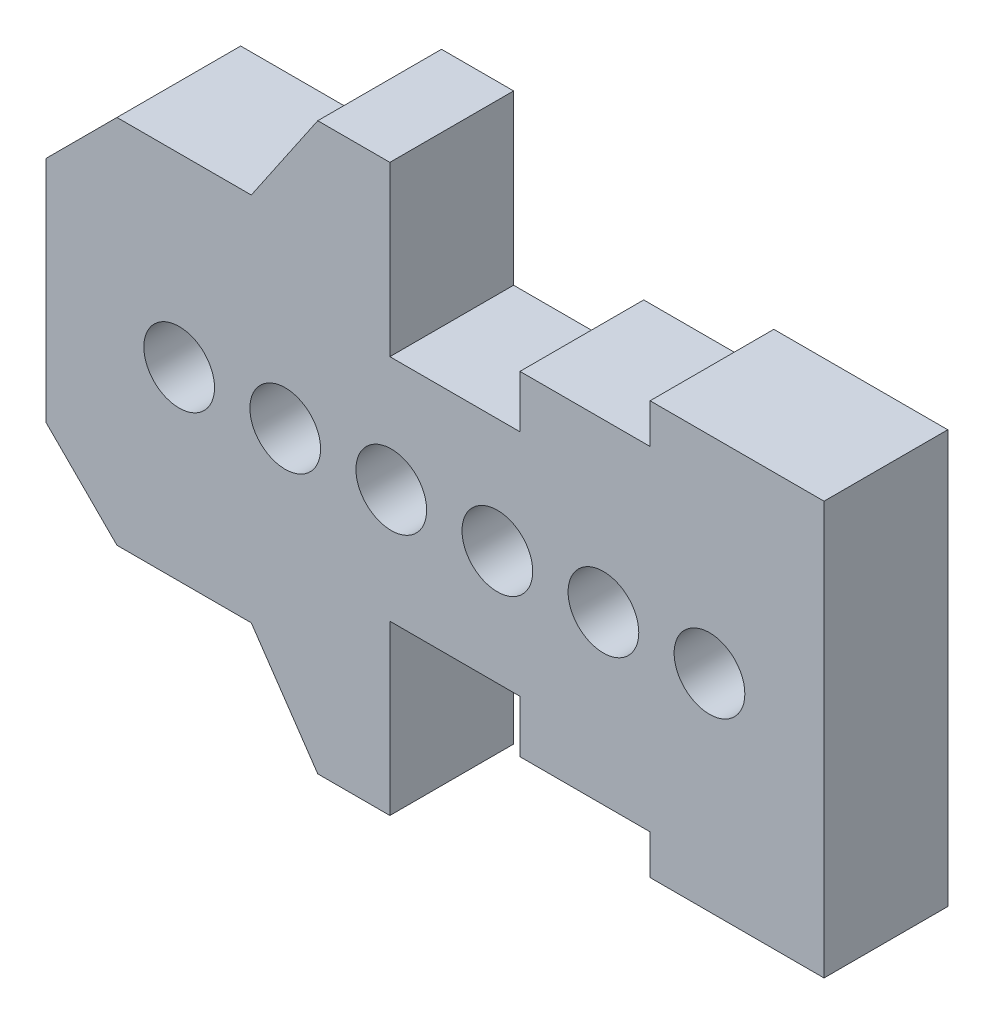
ISO-10303-21;
HEADER;
FILE_DESCRIPTION(('STEP AP214'),'2;1');
FILE_NAME('part.step','',(''),(''),'','','');
FILE_SCHEMA(('AUTOMOTIVE_DESIGN { 1 0 10303 214 1 1 1 1 }'));
ENDSEC;
DATA;
#1=APPLICATION_CONTEXT('core data for automotive mechanical design processes');
#2=APPLICATION_PROTOCOL_DEFINITION('international standard','automotive_design',2000,#1);
#3=PRODUCT_CONTEXT('',#1,'mechanical');
#4=PRODUCT('Part','Part','',(#3));
#5=PRODUCT_RELATED_PRODUCT_CATEGORY('part','',(#4));
#6=PRODUCT_DEFINITION_FORMATION('','',#4);
#7=PRODUCT_DEFINITION_CONTEXT('part definition',#1,'design');
#8=PRODUCT_DEFINITION('design','',#6,#7);
#9=PRODUCT_DEFINITION_SHAPE('','',#8);
#10=(LENGTH_UNIT() NAMED_UNIT(*) SI_UNIT(.MILLI.,.METRE.));
#11=(NAMED_UNIT(*) PLANE_ANGLE_UNIT() SI_UNIT($,.RADIAN.));
#12=(NAMED_UNIT(*) SI_UNIT($,.STERADIAN.) SOLID_ANGLE_UNIT());
#13=UNCERTAINTY_MEASURE_WITH_UNIT(LENGTH_MEASURE(1.E-05),#10,'distance_accuracy_value','');
#14=(GEOMETRIC_REPRESENTATION_CONTEXT(3) GLOBAL_UNCERTAINTY_ASSIGNED_CONTEXT((#13)) GLOBAL_UNIT_ASSIGNED_CONTEXT((#10,
#11,#12)) REPRESENTATION_CONTEXT('',''));
#15=CARTESIAN_POINT('',(0.,0.,0.));
#16=DIRECTION('',(0.,0.,1.));
#17=DIRECTION('',(1.,0.,0.));
#18=AXIS2_PLACEMENT_3D('',#15,#16,#17);
#19=CARTESIAN_POINT('',(-43.6968982711021,43.6968982711021,22.225));
#20=DIRECTION('',(-0.707106781186547,0.707106781186548,0.));
#21=DIRECTION('',(-0.707106781186548,-0.707106781186547,0.));
#22=AXIS2_PLACEMENT_3D('',#19,#20,#21);
#23=PLANE('',#22);
#24=DIRECTION('',(0.707106781186548,0.707106781186547,0.));
#25=VECTOR('',#24,1.);
#26=CARTESIAN_POINT('',(-43.6968982711021,43.6968982711021,0.));
#27=LINE('',#26,#25);
#28=CARTESIAN_POINT('',(-66.6653995361671,20.7283970060371,0.));
#29=VERTEX_POINT('',#28);
#30=CARTESIAN_POINT('',(-53.9653995361671,33.4283970060371,0.));
#31=VERTEX_POINT('',#30);
#32=EDGE_CURVE('E248',#29,#31,#27,.T.);
#33=ORIENTED_EDGE('',*,*,#32,.F.);
#34=DIRECTION('',(0.,0.,-1.));
#35=VECTOR('',#34,1.);
#36=CARTESIAN_POINT('',(-66.6653995361671,20.7283970060371,22.225));
#37=LINE('',#36,#35);
#38=CARTESIAN_POINT('',(-66.6653995361671,20.7283970060371,22.225));
#39=VERTEX_POINT('',#38);
#40=EDGE_CURVE('E11',#39,#29,#37,.T.);
#41=ORIENTED_EDGE('',*,*,#40,.F.);
#42=DIRECTION('',(0.707106781186548,0.707106781186547,0.));
#43=VECTOR('',#42,1.);
#44=CARTESIAN_POINT('',(-43.6968982711021,43.6968982711021,22.225));
#45=LINE('',#44,#43);
#46=CARTESIAN_POINT('',(-53.9653995361671,33.4283970060371,22.225));
#47=VERTEX_POINT('',#46);
#48=EDGE_CURVE('E806',#39,#47,#45,.T.);
#49=ORIENTED_EDGE('',*,*,#48,.T.);
#50=DIRECTION('',(0.,0.,-1.));
#51=VECTOR('',#50,1.);
#52=CARTESIAN_POINT('',(-53.9653995361671,33.4283970060371,22.225));
#53=LINE('',#52,#51);
#54=EDGE_CURVE('E57',#47,#31,#53,.T.);
#55=ORIENTED_EDGE('',*,*,#54,.T.);
#56=EDGE_LOOP('',(#33,#41,#49,#55));
#57=FACE_BOUND('',#56,.T.);
#58=ADVANCED_FACE('F39',(#57),#23,.T.);
#59=CARTESIAN_POINT('',(-66.6653995361671,0.,22.225));
#60=DIRECTION('',(1.,0.,0.));
#61=DIRECTION('',(0.,0.,-1.));
#62=AXIS2_PLACEMENT_3D('',#59,#60,#61);
#63=PLANE('',#62);
#64=DIRECTION('',(0.,-1.,0.));
#65=VECTOR('',#64,1.);
#66=CARTESIAN_POINT('',(-66.6653995361671,0.,0.));
#67=LINE('',#66,#65);
#68=CARTESIAN_POINT('',(-66.6653995361671,-20.4196029939629,0.));
#69=VERTEX_POINT('',#68);
#70=EDGE_CURVE('E251',#29,#69,#67,.T.);
#71=ORIENTED_EDGE('',*,*,#70,.T.);
#72=DIRECTION('',(0.,0.,-1.));
#73=VECTOR('',#72,1.);
#74=CARTESIAN_POINT('',(-66.6653995361671,-20.4196029939629,22.225));
#75=LINE('',#74,#73);
#76=CARTESIAN_POINT('',(-66.6653995361671,-20.4196029939629,22.225));
#77=VERTEX_POINT('',#76);
#78=EDGE_CURVE('E49',#77,#69,#75,.T.);
#79=ORIENTED_EDGE('',*,*,#78,.F.);
#80=DIRECTION('',(0.,-1.,0.));
#81=VECTOR('',#80,1.);
#82=CARTESIAN_POINT('',(-66.6653995361671,0.,22.225));
#83=LINE('',#82,#81);
#84=EDGE_CURVE('E733',#39,#77,#83,.T.);
#85=ORIENTED_EDGE('',*,*,#84,.F.);
#86=ORIENTED_EDGE('',*,*,#40,.T.);
#87=EDGE_LOOP('',(#71,#79,#85,#86));
#88=FACE_BOUND('',#87,.T.);
#89=ADVANCED_FACE('F411',(#88),#63,.F.);
#90=CARTESIAN_POINT('',(-43.5425012650649,-43.542501265065,22.225));
#91=DIRECTION('',(0.707106781186547,0.707106781186548,0.));
#92=DIRECTION('',(-0.707106781186548,0.707106781186547,0.));
#93=AXIS2_PLACEMENT_3D('',#90,#91,#92);
#94=PLANE('',#93);
#95=DIRECTION('',(0.707106781186548,-0.707106781186547,0.));
#96=VECTOR('',#95,1.);
#97=CARTESIAN_POINT('',(-43.5425012650649,-43.542501265065,0.));
#98=LINE('',#97,#96);
#99=CARTESIAN_POINT('',(-53.9653995361671,-33.1196029939629,0.));
#100=VERTEX_POINT('',#99);
#101=EDGE_CURVE('E255',#69,#100,#98,.T.);
#102=ORIENTED_EDGE('',*,*,#101,.T.);
#103=DIRECTION('',(0.,0.,-1.));
#104=VECTOR('',#103,1.);
#105=CARTESIAN_POINT('',(-53.9653995361671,-33.1196029939629,22.225));
#106=LINE('',#105,#104);
#107=CARTESIAN_POINT('',(-53.9653995361671,-33.1196029939629,22.225));
#108=VERTEX_POINT('',#107);
#109=EDGE_CURVE('E397',#108,#100,#106,.T.);
#110=ORIENTED_EDGE('',*,*,#109,.F.);
#111=DIRECTION('',(0.707106781186548,-0.707106781186547,0.));
#112=VECTOR('',#111,1.);
#113=CARTESIAN_POINT('',(-43.5425012650649,-43.542501265065,22.225));
#114=LINE('',#113,#112);
#115=EDGE_CURVE('E407',#77,#108,#114,.T.);
#116=ORIENTED_EDGE('',*,*,#115,.F.);
#117=ORIENTED_EDGE('',*,*,#78,.T.);
#118=EDGE_LOOP('',(#102,#110,#116,#117));
#119=FACE_BOUND('',#118,.T.);
#120=ADVANCED_FACE('F404',(#119),#94,.F.);
#121=CARTESIAN_POINT('',(0.,-33.1196029939629,22.225));
#122=DIRECTION('',(0.,1.,0.));
#123=DIRECTION('',(0.,0.,1.));
#124=AXIS2_PLACEMENT_3D('',#121,#122,#123);
#125=PLANE('',#124);
#126=DIRECTION('',(1.,0.,0.));
#127=VECTOR('',#126,1.);
#128=CARTESIAN_POINT('',(0.,-33.1196029939629,0.));
#129=LINE('',#128,#127);
#130=CARTESIAN_POINT('',(-29.8353995361671,-33.1196029939629,0.));
#131=VERTEX_POINT('',#130);
#132=EDGE_CURVE('E259',#100,#131,#129,.T.);
#133=ORIENTED_EDGE('',*,*,#132,.T.);
#134=DIRECTION('',(0.,0.,-1.));
#135=VECTOR('',#134,1.);
#136=CARTESIAN_POINT('',(-29.8353995361671,-33.1196029939629,22.225));
#137=LINE('',#136,#135);
#138=CARTESIAN_POINT('',(-29.8353995361671,-33.1196029939629,22.225));
#139=VERTEX_POINT('',#138);
#140=EDGE_CURVE('E393',#139,#131,#137,.T.);
#141=ORIENTED_EDGE('',*,*,#140,.F.);
#142=DIRECTION('',(1.,0.,0.));
#143=VECTOR('',#142,1.);
#144=CARTESIAN_POINT('',(0.,-33.1196029939629,22.225));
#145=LINE('',#144,#143);
#146=EDGE_CURVE('E728',#108,#139,#145,.T.);
#147=ORIENTED_EDGE('',*,*,#146,.F.);
#148=ORIENTED_EDGE('',*,*,#109,.T.);
#149=EDGE_LOOP('',(#133,#141,#147,#148));
#150=FACE_BOUND('',#149,.T.);
#151=ADVANCED_FACE('F535',(#150),#125,.F.);
#152=CARTESIAN_POINT('',(-35.7895566285672,-24.3783936455457,22.225));
#153=DIRECTION('',(0.826480672061512,0.562965095462189,0.));
#154=DIRECTION('',(-0.562965095462189,0.826480672061512,0.));
#155=AXIS2_PLACEMENT_3D('',#152,#153,#154);
#156=PLANE('',#155);
#157=DIRECTION('',(0.562965095462189,-0.826480672061512,0.));
#158=VECTOR('',#157,1.);
#159=CARTESIAN_POINT('',(-35.7895566285672,-24.3783936455457,0.));
#160=LINE('',#159,#158);
#161=CARTESIAN_POINT('',(-17.8973995361671,-50.6456029939629,0.));
#162=VERTEX_POINT('',#161);
#163=EDGE_CURVE('E263',#131,#162,#160,.T.);
#164=ORIENTED_EDGE('',*,*,#163,.T.);
#165=DIRECTION('',(0.,0.,-1.));
#166=VECTOR('',#165,1.);
#167=CARTESIAN_POINT('',(-17.8973995361671,-50.6456029939629,22.225));
#168=LINE('',#167,#166);
#169=CARTESIAN_POINT('',(-17.8973995361671,-50.6456029939629,22.225));
#170=VERTEX_POINT('',#169);
#171=EDGE_CURVE('E389',#170,#162,#168,.T.);
#172=ORIENTED_EDGE('',*,*,#171,.F.);
#173=DIRECTION('',(0.562965095462189,-0.826480672061512,0.));
#174=VECTOR('',#173,1.);
#175=CARTESIAN_POINT('',(-35.7895566285672,-24.3783936455457,22.225));
#176=LINE('',#175,#174);
#177=EDGE_CURVE('E723',#139,#170,#176,.T.);
#178=ORIENTED_EDGE('',*,*,#177,.F.);
#179=ORIENTED_EDGE('',*,*,#140,.T.);
#180=EDGE_LOOP('',(#164,#172,#178,#179));
#181=FACE_BOUND('',#180,.T.);
#182=ADVANCED_FACE('F531',(#181),#156,.F.);
#183=CARTESIAN_POINT('',(0.,-50.6456029939629,22.225));
#184=DIRECTION('',(0.,1.,0.));
#185=DIRECTION('',(0.,0.,1.));
#186=AXIS2_PLACEMENT_3D('',#183,#184,#185);
#187=PLANE('',#186);
#188=DIRECTION('',(1.,0.,0.));
#189=VECTOR('',#188,1.);
#190=CARTESIAN_POINT('',(0.,-50.6456029939629,0.));
#191=LINE('',#190,#189);
#192=CARTESIAN_POINT('',(-4.9433995361671,-50.6456029939629,0.));
#193=VERTEX_POINT('',#192);
#194=EDGE_CURVE('E267',#162,#193,#191,.T.);
#195=ORIENTED_EDGE('',*,*,#194,.T.);
#196=DIRECTION('',(0.,0.,-1.));
#197=VECTOR('',#196,1.);
#198=CARTESIAN_POINT('',(-4.9433995361671,-50.6456029939629,22.225));
#199=LINE('',#198,#197);
#200=CARTESIAN_POINT('',(-4.9433995361671,-50.6456029939629,22.225));
#201=VERTEX_POINT('',#200);
#202=EDGE_CURVE('E385',#201,#193,#199,.T.);
#203=ORIENTED_EDGE('',*,*,#202,.F.);
#204=DIRECTION('',(1.,0.,0.));
#205=VECTOR('',#204,1.);
#206=CARTESIAN_POINT('',(0.,-50.6456029939629,22.225));
#207=LINE('',#206,#205);
#208=EDGE_CURVE('E727',#170,#201,#207,.T.);
#209=ORIENTED_EDGE('',*,*,#208,.F.);
#210=ORIENTED_EDGE('',*,*,#171,.T.);
#211=EDGE_LOOP('',(#195,#203,#209,#210));
#212=FACE_BOUND('',#211,.T.);
#213=ADVANCED_FACE('F527',(#212),#187,.F.);
#214=CARTESIAN_POINT('',(-4.94339953616709,0.,22.225));
#215=DIRECTION('',(-1.,0.,0.));
#216=DIRECTION('',(0.,-1.,0.));
#217=AXIS2_PLACEMENT_3D('',#214,#215,#216);
#218=PLANE('',#217);
#219=DIRECTION('',(0.,1.,0.));
#220=VECTOR('',#219,1.);
#221=CARTESIAN_POINT('',(-4.94339953616709,0.,0.));
#222=LINE('',#221,#220);
#223=CARTESIAN_POINT('',(-4.94339953616709,-20.4196029939629,0.));
#224=VERTEX_POINT('',#223);
#225=EDGE_CURVE('E271',#193,#224,#222,.T.);
#226=ORIENTED_EDGE('',*,*,#225,.T.);
#227=DIRECTION('',(0.,0.,-1.));
#228=VECTOR('',#227,1.);
#229=CARTESIAN_POINT('',(-4.94339953616709,-20.4196029939629,22.225));
#230=LINE('',#229,#228);
#231=CARTESIAN_POINT('',(-4.94339953616709,-20.4196029939629,22.225));
#232=VERTEX_POINT('',#231);
#233=EDGE_CURVE('E381',#232,#224,#230,.T.);
#234=ORIENTED_EDGE('',*,*,#233,.F.);
#235=DIRECTION('',(0.,1.,0.));
#236=VECTOR('',#235,1.);
#237=CARTESIAN_POINT('',(-4.94339953616709,0.,22.225));
#238=LINE('',#237,#236);
#239=EDGE_CURVE('E739',#201,#232,#238,.T.);
#240=ORIENTED_EDGE('',*,*,#239,.F.);
#241=ORIENTED_EDGE('',*,*,#202,.T.);
#242=EDGE_LOOP('',(#226,#234,#240,#241));
#243=FACE_BOUND('',#242,.T.);
#244=ADVANCED_FACE('F523',(#243),#218,.F.);
#245=CARTESIAN_POINT('',(0.,-20.4196029939629,22.225));
#246=DIRECTION('',(0.,1.,0.));
#247=DIRECTION('',(-1.,0.,0.));
#248=AXIS2_PLACEMENT_3D('',#245,#246,#247);
#249=PLANE('',#248);
#250=DIRECTION('',(1.,0.,0.));
#251=VECTOR('',#250,1.);
#252=CARTESIAN_POINT('',(0.,-20.4196029939629,0.));
#253=LINE('',#252,#251);
#254=CARTESIAN_POINT('',(18.4246004638329,-20.4196029939629,0.));
#255=VERTEX_POINT('',#254);
#256=EDGE_CURVE('E275',#224,#255,#253,.T.);
#257=ORIENTED_EDGE('',*,*,#256,.T.);
#258=DIRECTION('',(0.,0.,-1.));
#259=VECTOR('',#258,1.);
#260=CARTESIAN_POINT('',(18.4246004638329,-20.4196029939629,22.225));
#261=LINE('',#260,#259);
#262=CARTESIAN_POINT('',(18.4246004638329,-20.4196029939629,22.225));
#263=VERTEX_POINT('',#262);
#264=EDGE_CURVE('E377',#263,#255,#261,.T.);
#265=ORIENTED_EDGE('',*,*,#264,.F.);
#266=DIRECTION('',(1.,0.,0.));
#267=VECTOR('',#266,1.);
#268=CARTESIAN_POINT('',(0.,-20.4196029939629,22.225));
#269=LINE('',#268,#267);
#270=EDGE_CURVE('E743',#232,#263,#269,.T.);
#271=ORIENTED_EDGE('',*,*,#270,.F.);
#272=ORIENTED_EDGE('',*,*,#233,.T.);
#273=EDGE_LOOP('',(#257,#265,#271,#272));
#274=FACE_BOUND('',#273,.T.);
#275=ADVANCED_FACE('F519',(#274),#249,.F.);
#276=CARTESIAN_POINT('',(18.4246004638329,0.,22.225));
#277=DIRECTION('',(1.,0.,0.));
#278=DIRECTION('',(0.,1.,0.));
#279=AXIS2_PLACEMENT_3D('',#276,#277,#278);
#280=PLANE('',#279);
#281=DIRECTION('',(0.,-1.,0.));
#282=VECTOR('',#281,1.);
#283=CARTESIAN_POINT('',(18.4246004638329,0.,0.));
#284=LINE('',#283,#282);
#285=CARTESIAN_POINT('',(18.4246004638329,-29.8176029939629,0.));
#286=VERTEX_POINT('',#285);
#287=EDGE_CURVE('E279',#255,#286,#284,.T.);
#288=ORIENTED_EDGE('',*,*,#287,.T.);
#289=DIRECTION('',(0.,0.,-1.));
#290=VECTOR('',#289,1.);
#291=CARTESIAN_POINT('',(18.4246004638329,-29.8176029939629,22.225));
#292=LINE('',#291,#290);
#293=CARTESIAN_POINT('',(18.4246004638329,-29.8176029939629,22.225));
#294=VERTEX_POINT('',#293);
#295=EDGE_CURVE('E373',#294,#286,#292,.T.);
#296=ORIENTED_EDGE('',*,*,#295,.F.);
#297=DIRECTION('',(0.,-1.,0.));
#298=VECTOR('',#297,1.);
#299=CARTESIAN_POINT('',(18.4246004638329,0.,22.225));
#300=LINE('',#299,#298);
#301=EDGE_CURVE('E747',#263,#294,#300,.T.);
#302=ORIENTED_EDGE('',*,*,#301,.F.);
#303=ORIENTED_EDGE('',*,*,#264,.T.);
#304=EDGE_LOOP('',(#288,#296,#302,#303));
#305=FACE_BOUND('',#304,.T.);
#306=ADVANCED_FACE('F515',(#305),#280,.F.);
#307=CARTESIAN_POINT('',(0.,-29.8176029939629,22.225));
#308=DIRECTION('',(0.,1.,0.));
#309=DIRECTION('',(0.,0.,1.));
#310=AXIS2_PLACEMENT_3D('',#307,#308,#309);
#311=PLANE('',#310);
#312=DIRECTION('',(1.,0.,0.));
#313=VECTOR('',#312,1.);
#314=CARTESIAN_POINT('',(0.,-29.8176029939629,0.));
#315=LINE('',#314,#313);
#316=CARTESIAN_POINT('',(41.7926004638329,-29.8176029939629,0.));
#317=VERTEX_POINT('',#316);
#318=EDGE_CURVE('E283',#286,#317,#315,.T.);
#319=ORIENTED_EDGE('',*,*,#318,.T.);
#320=DIRECTION('',(0.,0.,-1.));
#321=VECTOR('',#320,1.);
#322=CARTESIAN_POINT('',(41.7926004638329,-29.8176029939629,22.225));
#323=LINE('',#322,#321);
#324=CARTESIAN_POINT('',(41.7926004638329,-29.8176029939629,22.225));
#325=VERTEX_POINT('',#324);
#326=EDGE_CURVE('E369',#325,#317,#323,.T.);
#327=ORIENTED_EDGE('',*,*,#326,.F.);
#328=DIRECTION('',(1.,0.,0.));
#329=VECTOR('',#328,1.);
#330=CARTESIAN_POINT('',(0.,-29.8176029939629,22.225));
#331=LINE('',#330,#329);
#332=EDGE_CURVE('E751',#294,#325,#331,.T.);
#333=ORIENTED_EDGE('',*,*,#332,.F.);
#334=ORIENTED_EDGE('',*,*,#295,.T.);
#335=EDGE_LOOP('',(#319,#327,#333,#334));
#336=FACE_BOUND('',#335,.T.);
#337=ADVANCED_FACE('F511',(#336),#311,.F.);
#338=CARTESIAN_POINT('',(41.7926004638329,0.,22.225));
#339=DIRECTION('',(1.,0.,0.));
#340=DIRECTION('',(0.,0.,-1.));
#341=AXIS2_PLACEMENT_3D('',#338,#339,#340);
#342=PLANE('',#341);
#343=DIRECTION('',(0.,-1.,0.));
#344=VECTOR('',#343,1.);
#345=CARTESIAN_POINT('',(41.7926004638329,0.,0.));
#346=LINE('',#345,#344);
#347=CARTESIAN_POINT('',(41.7926004638329,-36.9296029939629,0.));
#348=VERTEX_POINT('',#347);
#349=EDGE_CURVE('E287',#317,#348,#346,.T.);
#350=ORIENTED_EDGE('',*,*,#349,.T.);
#351=DIRECTION('',(0.,0.,-1.));
#352=VECTOR('',#351,1.);
#353=CARTESIAN_POINT('',(41.7926004638329,-36.9296029939629,22.225));
#354=LINE('',#353,#352);
#355=CARTESIAN_POINT('',(41.7926004638329,-36.9296029939629,22.225));
#356=VERTEX_POINT('',#355);
#357=EDGE_CURVE('E365',#356,#348,#354,.T.);
#358=ORIENTED_EDGE('',*,*,#357,.F.);
#359=DIRECTION('',(0.,-1.,0.));
#360=VECTOR('',#359,1.);
#361=CARTESIAN_POINT('',(41.7926004638329,0.,22.225));
#362=LINE('',#361,#360);
#363=EDGE_CURVE('E755',#325,#356,#362,.T.);
#364=ORIENTED_EDGE('',*,*,#363,.F.);
#365=ORIENTED_EDGE('',*,*,#326,.T.);
#366=EDGE_LOOP('',(#350,#358,#364,#365));
#367=FACE_BOUND('',#366,.T.);
#368=ADVANCED_FACE('F507',(#367),#342,.F.);
#369=CARTESIAN_POINT('',(0.,-36.9296029939629,22.225));
#370=DIRECTION('',(0.,1.,0.));
#371=DIRECTION('',(0.,0.,1.));
#372=AXIS2_PLACEMENT_3D('',#369,#370,#371);
#373=PLANE('',#372);
#374=DIRECTION('',(1.,0.,0.));
#375=VECTOR('',#374,1.);
#376=CARTESIAN_POINT('',(0.,-36.9296029939629,0.));
#377=LINE('',#376,#375);
#378=CARTESIAN_POINT('',(73.0346004638329,-36.9296029939629,0.));
#379=VERTEX_POINT('',#378);
#380=EDGE_CURVE('E291',#348,#379,#377,.T.);
#381=ORIENTED_EDGE('',*,*,#380,.T.);
#382=DIRECTION('',(0.,0.,-1.));
#383=VECTOR('',#382,1.);
#384=CARTESIAN_POINT('',(73.0346004638329,-36.9296029939629,22.225));
#385=LINE('',#384,#383);
#386=CARTESIAN_POINT('',(73.0346004638329,-36.9296029939629,22.225));
#387=VERTEX_POINT('',#386);
#388=EDGE_CURVE('E361',#387,#379,#385,.T.);
#389=ORIENTED_EDGE('',*,*,#388,.F.);
#390=DIRECTION('',(1.,0.,0.));
#391=VECTOR('',#390,1.);
#392=CARTESIAN_POINT('',(0.,-36.9296029939629,22.225));
#393=LINE('',#392,#391);
#394=EDGE_CURVE('E759',#356,#387,#393,.T.);
#395=ORIENTED_EDGE('',*,*,#394,.F.);
#396=ORIENTED_EDGE('',*,*,#357,.T.);
#397=EDGE_LOOP('',(#381,#389,#395,#396));
#398=FACE_BOUND('',#397,.T.);
#399=ADVANCED_FACE('F503',(#398),#373,.F.);
#400=CARTESIAN_POINT('',(73.0346004638329,0.,22.225));
#401=DIRECTION('',(-1.,0.,0.));
#402=DIRECTION('',(0.,0.,1.));
#403=AXIS2_PLACEMENT_3D('',#400,#401,#402);
#404=PLANE('',#403);
#405=DIRECTION('',(0.,1.,0.));
#406=VECTOR('',#405,1.);
#407=CARTESIAN_POINT('',(73.0346004638329,0.,0.));
#408=LINE('',#407,#406);
#409=CARTESIAN_POINT('',(73.0346004638329,37.2383970060371,0.));
#410=VERTEX_POINT('',#409);
#411=EDGE_CURVE('E295',#379,#410,#408,.T.);
#412=ORIENTED_EDGE('',*,*,#411,.T.);
#413=DIRECTION('',(0.,0.,-1.));
#414=VECTOR('',#413,1.);
#415=CARTESIAN_POINT('',(73.0346004638329,37.2383970060371,22.225));
#416=LINE('',#415,#414);
#417=CARTESIAN_POINT('',(73.0346004638329,37.2383970060371,22.225));
#418=VERTEX_POINT('',#417);
#419=EDGE_CURVE('E358',#418,#410,#416,.T.);
#420=ORIENTED_EDGE('',*,*,#419,.F.);
#421=DIRECTION('',(0.,1.,0.));
#422=VECTOR('',#421,1.);
#423=CARTESIAN_POINT('',(73.0346004638329,0.,22.225));
#424=LINE('',#423,#422);
#425=EDGE_CURVE('E763',#387,#418,#424,.T.);
#426=ORIENTED_EDGE('',*,*,#425,.F.);
#427=ORIENTED_EDGE('',*,*,#388,.T.);
#428=EDGE_LOOP('',(#412,#420,#426,#427));
#429=FACE_BOUND('',#428,.T.);
#430=ADVANCED_FACE('F499',(#429),#404,.F.);
#431=CARTESIAN_POINT('',(0.,37.2383970060371,22.225));
#432=DIRECTION('',(0.,1.,0.));
#433=DIRECTION('',(0.,0.,1.));
#434=AXIS2_PLACEMENT_3D('',#431,#432,#433);
#435=PLANE('',#434);
#436=DIRECTION('',(1.,0.,0.));
#437=VECTOR('',#436,1.);
#438=CARTESIAN_POINT('',(0.,37.2383970060371,0.));
#439=LINE('',#438,#437);
#440=CARTESIAN_POINT('',(41.7926004638329,37.2383970060371,0.));
#441=VERTEX_POINT('',#440);
#442=EDGE_CURVE('E299',#441,#410,#439,.T.);
#443=ORIENTED_EDGE('',*,*,#442,.F.);
#444=DIRECTION('',(0.,0.,-1.));
#445=VECTOR('',#444,1.);
#446=CARTESIAN_POINT('',(41.7926004638329,37.2383970060371,22.225));
#447=LINE('',#446,#445);
#448=CARTESIAN_POINT('',(41.7926004638329,37.2383970060371,22.225));
#449=VERTEX_POINT('',#448);
#450=EDGE_CURVE('E355',#449,#441,#447,.T.);
#451=ORIENTED_EDGE('',*,*,#450,.F.);
#452=DIRECTION('',(1.,0.,0.));
#453=VECTOR('',#452,1.);
#454=CARTESIAN_POINT('',(0.,37.2383970060371,22.225));
#455=LINE('',#454,#453);
#456=EDGE_CURVE('E766',#449,#418,#455,.T.);
#457=ORIENTED_EDGE('',*,*,#456,.T.);
#458=ORIENTED_EDGE('',*,*,#419,.T.);
#459=EDGE_LOOP('',(#443,#451,#457,#458));
#460=FACE_BOUND('',#459,.T.);
#461=ADVANCED_FACE('F495',(#460),#435,.T.);
#462=CARTESIAN_POINT('',(41.7926004638329,0.,22.225));
#463=DIRECTION('',(-1.,0.,0.));
#464=DIRECTION('',(0.,0.,1.));
#465=AXIS2_PLACEMENT_3D('',#462,#463,#464);
#466=PLANE('',#465);
#467=DIRECTION('',(0.,1.,0.));
#468=VECTOR('',#467,1.);
#469=CARTESIAN_POINT('',(41.7926004638329,0.,0.));
#470=LINE('',#469,#468);
#471=CARTESIAN_POINT('',(41.7926004638329,30.1263970060371,0.));
#472=VERTEX_POINT('',#471);
#473=EDGE_CURVE('E303',#472,#441,#470,.T.);
#474=ORIENTED_EDGE('',*,*,#473,.F.);
#475=DIRECTION('',(0.,0.,-1.));
#476=VECTOR('',#475,1.);
#477=CARTESIAN_POINT('',(41.7926004638329,30.1263970060371,22.225));
#478=LINE('',#477,#476);
#479=CARTESIAN_POINT('',(41.7926004638329,30.1263970060371,22.225));
#480=VERTEX_POINT('',#479);
#481=EDGE_CURVE('E352',#480,#472,#478,.T.);
#482=ORIENTED_EDGE('',*,*,#481,.F.);
#483=DIRECTION('',(0.,1.,0.));
#484=VECTOR('',#483,1.);
#485=CARTESIAN_POINT('',(41.7926004638329,0.,22.225));
#486=LINE('',#485,#484);
#487=EDGE_CURVE('E770',#480,#449,#486,.T.);
#488=ORIENTED_EDGE('',*,*,#487,.T.);
#489=ORIENTED_EDGE('',*,*,#450,.T.);
#490=EDGE_LOOP('',(#474,#482,#488,#489));
#491=FACE_BOUND('',#490,.T.);
#492=ADVANCED_FACE('F491',(#491),#466,.T.);
#493=CARTESIAN_POINT('',(0.,30.1263970060371,22.225));
#494=DIRECTION('',(0.,1.,0.));
#495=DIRECTION('',(0.,0.,1.));
#496=AXIS2_PLACEMENT_3D('',#493,#494,#495);
#497=PLANE('',#496);
#498=DIRECTION('',(1.,0.,0.));
#499=VECTOR('',#498,1.);
#500=CARTESIAN_POINT('',(0.,30.1263970060371,0.));
#501=LINE('',#500,#499);
#502=CARTESIAN_POINT('',(18.4246004638329,30.1263970060371,0.));
#503=VERTEX_POINT('',#502);
#504=EDGE_CURVE('E307',#503,#472,#501,.T.);
#505=ORIENTED_EDGE('',*,*,#504,.F.);
#506=DIRECTION('',(0.,0.,-1.));
#507=VECTOR('',#506,1.);
#508=CARTESIAN_POINT('',(18.4246004638329,30.1263970060371,22.225));
#509=LINE('',#508,#507);
#510=CARTESIAN_POINT('',(18.4246004638329,30.1263970060371,22.225));
#511=VERTEX_POINT('',#510);
#512=EDGE_CURVE('E349',#511,#503,#509,.T.);
#513=ORIENTED_EDGE('',*,*,#512,.F.);
#514=DIRECTION('',(1.,0.,0.));
#515=VECTOR('',#514,1.);
#516=CARTESIAN_POINT('',(0.,30.1263970060371,22.225));
#517=LINE('',#516,#515);
#518=EDGE_CURVE('E774',#511,#480,#517,.T.);
#519=ORIENTED_EDGE('',*,*,#518,.T.);
#520=ORIENTED_EDGE('',*,*,#481,.T.);
#521=EDGE_LOOP('',(#505,#513,#519,#520));
#522=FACE_BOUND('',#521,.T.);
#523=ADVANCED_FACE('F487',(#522),#497,.T.);
#524=CARTESIAN_POINT('',(18.4246004638329,0.,22.225));
#525=DIRECTION('',(-1.,0.,0.));
#526=DIRECTION('',(0.,-1.,0.));
#527=AXIS2_PLACEMENT_3D('',#524,#525,#526);
#528=PLANE('',#527);
#529=DIRECTION('',(0.,1.,0.));
#530=VECTOR('',#529,1.);
#531=CARTESIAN_POINT('',(18.4246004638329,0.,0.));
#532=LINE('',#531,#530);
#533=CARTESIAN_POINT('',(18.4246004638329,20.7283970060371,0.));
#534=VERTEX_POINT('',#533);
#535=EDGE_CURVE('E311',#534,#503,#532,.T.);
#536=ORIENTED_EDGE('',*,*,#535,.F.);
#537=DIRECTION('',(0.,0.,-1.));
#538=VECTOR('',#537,1.);
#539=CARTESIAN_POINT('',(18.4246004638329,20.7283970060371,22.225));
#540=LINE('',#539,#538);
#541=CARTESIAN_POINT('',(18.4246004638329,20.7283970060371,22.225));
#542=VERTEX_POINT('',#541);
#543=EDGE_CURVE('E346',#542,#534,#540,.T.);
#544=ORIENTED_EDGE('',*,*,#543,.F.);
#545=DIRECTION('',(0.,1.,0.));
#546=VECTOR('',#545,1.);
#547=CARTESIAN_POINT('',(18.4246004638329,0.,22.225));
#548=LINE('',#547,#546);
#549=EDGE_CURVE('E778',#542,#511,#548,.T.);
#550=ORIENTED_EDGE('',*,*,#549,.T.);
#551=ORIENTED_EDGE('',*,*,#512,.T.);
#552=EDGE_LOOP('',(#536,#544,#550,#551));
#553=FACE_BOUND('',#552,.T.);
#554=ADVANCED_FACE('F483',(#553),#528,.T.);
#555=CARTESIAN_POINT('',(0.,20.7283970060371,22.225));
#556=DIRECTION('',(0.,1.,0.));
#557=DIRECTION('',(-1.,0.,0.));
#558=AXIS2_PLACEMENT_3D('',#555,#556,#557);
#559=PLANE('',#558);
#560=DIRECTION('',(1.,0.,0.));
#561=VECTOR('',#560,1.);
#562=CARTESIAN_POINT('',(0.,20.7283970060371,0.));
#563=LINE('',#562,#561);
#564=CARTESIAN_POINT('',(-4.94339953616709,20.7283970060371,0.));
#565=VERTEX_POINT('',#564);
#566=EDGE_CURVE('E315',#565,#534,#563,.T.);
#567=ORIENTED_EDGE('',*,*,#566,.F.);
#568=DIRECTION('',(0.,0.,-1.));
#569=VECTOR('',#568,1.);
#570=CARTESIAN_POINT('',(-4.94339953616709,20.7283970060371,22.225));
#571=LINE('',#570,#569);
#572=CARTESIAN_POINT('',(-4.94339953616709,20.7283970060371,22.225));
#573=VERTEX_POINT('',#572);
#574=EDGE_CURVE('E343',#573,#565,#571,.T.);
#575=ORIENTED_EDGE('',*,*,#574,.F.);
#576=DIRECTION('',(1.,0.,0.));
#577=VECTOR('',#576,1.);
#578=CARTESIAN_POINT('',(0.,20.7283970060371,22.225));
#579=LINE('',#578,#577);
#580=EDGE_CURVE('E782',#573,#542,#579,.T.);
#581=ORIENTED_EDGE('',*,*,#580,.T.);
#582=ORIENTED_EDGE('',*,*,#543,.T.);
#583=EDGE_LOOP('',(#567,#575,#581,#582));
#584=FACE_BOUND('',#583,.T.);
#585=ADVANCED_FACE('F479',(#584),#559,.T.);
#586=CARTESIAN_POINT('',(-4.94339953616709,0.,22.225));
#587=DIRECTION('',(1.,0.,0.));
#588=DIRECTION('',(0.,1.,0.));
#589=AXIS2_PLACEMENT_3D('',#586,#587,#588);
#590=PLANE('',#589);
#591=DIRECTION('',(0.,-1.,0.));
#592=VECTOR('',#591,1.);
#593=CARTESIAN_POINT('',(-4.94339953616709,0.,0.));
#594=LINE('',#593,#592);
#595=CARTESIAN_POINT('',(-4.9433995361671,50.9543970060371,0.));
#596=VERTEX_POINT('',#595);
#597=EDGE_CURVE('E319',#596,#565,#594,.T.);
#598=ORIENTED_EDGE('',*,*,#597,.F.);
#599=DIRECTION('',(0.,0.,-1.));
#600=VECTOR('',#599,1.);
#601=CARTESIAN_POINT('',(-4.9433995361671,50.9543970060371,22.225));
#602=LINE('',#601,#600);
#603=CARTESIAN_POINT('',(-4.9433995361671,50.9543970060371,22.225));
#604=VERTEX_POINT('',#603);
#605=EDGE_CURVE('E201',#604,#596,#602,.T.);
#606=ORIENTED_EDGE('',*,*,#605,.F.);
#607=DIRECTION('',(0.,-1.,0.));
#608=VECTOR('',#607,1.);
#609=CARTESIAN_POINT('',(-4.94339953616709,0.,22.225));
#610=LINE('',#609,#608);
#611=EDGE_CURVE('E213',#604,#573,#610,.T.);
#612=ORIENTED_EDGE('',*,*,#611,.T.);
#613=ORIENTED_EDGE('',*,*,#574,.T.);
#614=EDGE_LOOP('',(#598,#606,#612,#613));
#615=FACE_BOUND('',#614,.T.);
#616=ADVANCED_FACE('F476',(#615),#590,.T.);
#617=CARTESIAN_POINT('',(0.,50.9543970060371,22.225));
#618=DIRECTION('',(0.,1.,0.));
#619=DIRECTION('',(0.,0.,1.));
#620=AXIS2_PLACEMENT_3D('',#617,#618,#619);
#621=PLANE('',#620);
#622=DIRECTION('',(1.,0.,0.));
#623=VECTOR('',#622,1.);
#624=CARTESIAN_POINT('',(0.,50.9543970060371,0.));
#625=LINE('',#624,#623);
#626=CARTESIAN_POINT('',(-17.8973995361671,50.9543970060371,0.));
#627=VERTEX_POINT('',#626);
#628=EDGE_CURVE('E196',#627,#596,#625,.T.);
#629=ORIENTED_EDGE('',*,*,#628,.F.);
#630=DIRECTION('',(0.,0.,-1.));
#631=VECTOR('',#630,1.);
#632=CARTESIAN_POINT('',(-17.8973995361671,50.9543970060371,22.225));
#633=LINE('',#632,#631);
#634=CARTESIAN_POINT('',(-17.8973995361671,50.9543970060371,22.225));
#635=VERTEX_POINT('',#634);
#636=EDGE_CURVE('E191',#635,#627,#633,.T.);
#637=ORIENTED_EDGE('',*,*,#636,.F.);
#638=DIRECTION('',(1.,0.,0.));
#639=VECTOR('',#638,1.);
#640=CARTESIAN_POINT('',(0.,50.9543970060371,22.225));
#641=LINE('',#640,#639);
#642=EDGE_CURVE('E194',#635,#604,#641,.T.);
#643=ORIENTED_EDGE('',*,*,#642,.T.);
#644=ORIENTED_EDGE('',*,*,#605,.T.);
#645=EDGE_LOOP('',(#629,#637,#643,#644));
#646=FACE_BOUND('',#645,.T.);
#647=ADVANCED_FACE('F193',(#646),#621,.T.);
#648=CARTESIAN_POINT('',(-35.9332322356198,24.4762596387555,22.225));
#649=DIRECTION('',(-0.826480672061512,0.562965095462189,0.));
#650=DIRECTION('',(-0.562965095462189,-0.826480672061512,0.));
#651=AXIS2_PLACEMENT_3D('',#648,#649,#650);
#652=PLANE('',#651);
#653=DIRECTION('',(0.562965095462189,0.826480672061512,0.));
#654=VECTOR('',#653,1.);
#655=CARTESIAN_POINT('',(-35.9332322356198,24.4762596387555,0.));
#656=LINE('',#655,#654);
#657=CARTESIAN_POINT('',(-29.8353995361671,33.4283970060371,0.));
#658=VERTEX_POINT('',#657);
#659=EDGE_CURVE('E325',#658,#627,#656,.T.);
#660=ORIENTED_EDGE('',*,*,#659,.F.);
#661=DIRECTION('',(0.,0.,-1.));
#662=VECTOR('',#661,1.);
#663=CARTESIAN_POINT('',(-29.8353995361671,33.4283970060371,22.225));
#664=LINE('',#663,#662);
#665=CARTESIAN_POINT('',(-29.8353995361671,33.4283970060371,22.225));
#666=VERTEX_POINT('',#665);
#667=EDGE_CURVE('E124',#666,#658,#664,.T.);
#668=ORIENTED_EDGE('',*,*,#667,.F.);
#669=DIRECTION('',(0.562965095462189,0.826480672061512,0.));
#670=VECTOR('',#669,1.);
#671=CARTESIAN_POINT('',(-35.9332322356198,24.4762596387555,22.225));
#672=LINE('',#671,#670);
#673=EDGE_CURVE('E210',#666,#635,#672,.T.);
#674=ORIENTED_EDGE('',*,*,#673,.T.);
#675=ORIENTED_EDGE('',*,*,#636,.T.);
#676=EDGE_LOOP('',(#660,#668,#674,#675));
#677=FACE_BOUND('',#676,.T.);
#678=ADVANCED_FACE('F216',(#677),#652,.T.);
#679=CARTESIAN_POINT('',(0.,33.4283970060371,22.225));
#680=DIRECTION('',(0.,1.,0.));
#681=DIRECTION('',(0.,0.,1.));
#682=AXIS2_PLACEMENT_3D('',#679,#680,#681);
#683=PLANE('',#682);
#684=DIRECTION('',(1.,0.,0.));
#685=VECTOR('',#684,1.);
#686=CARTESIAN_POINT('',(0.,33.4283970060371,0.));
#687=LINE('',#686,#685);
#688=EDGE_CURVE('E328',#31,#658,#687,.T.);
#689=ORIENTED_EDGE('',*,*,#688,.F.);
#690=ORIENTED_EDGE('',*,*,#54,.F.);
#691=DIRECTION('',(1.,0.,0.));
#692=VECTOR('',#691,1.);
#693=CARTESIAN_POINT('',(0.,33.4283970060371,22.225));
#694=LINE('',#693,#692);
#695=EDGE_CURVE('E218',#47,#666,#694,.T.);
#696=ORIENTED_EDGE('',*,*,#695,.T.);
#697=ORIENTED_EDGE('',*,*,#667,.T.);
#698=EDGE_LOOP('',(#689,#690,#696,#697));
#699=FACE_BOUND('',#698,.T.);
#700=ADVANCED_FACE('F427',(#699),#683,.T.);
#701=CARTESIAN_POINT('',(-42.7893995361671,0.15439700603712,22.225));
#702=DIRECTION('',(0.,0.,-1.));
#703=DIRECTION('',(-1.,0.,0.));
#704=AXIS2_PLACEMENT_3D('',#701,#702,#703);
#705=CYLINDRICAL_SURFACE('',#704,6.35);
#706=CARTESIAN_POINT('',(-42.7893995361671,0.15439700603712,22.225));
#707=DIRECTION('',(0.,0.,1.));
#708=DIRECTION('',(1.,0.,0.));
#709=AXIS2_PLACEMENT_3D('',#706,#707,#708);
#710=CIRCLE('',#709,6.35);
#711=CARTESIAN_POINT('',(-36.4393995361671,0.15439700603712,22.225));
#712=VERTEX_POINT('',#711);
#713=EDGE_CURVE('E809',#712,#712,#710,.T.);
#714=ORIENTED_EDGE('',*,*,#713,.T.);
#715=EDGE_LOOP('',(#714));
#716=FACE_BOUND('',#715,.T.);
#717=CARTESIAN_POINT('',(-42.7893995361671,0.15439700603712,0.));
#718=DIRECTION('',(0.,0.,1.));
#719=DIRECTION('',(1.,0.,0.));
#720=AXIS2_PLACEMENT_3D('',#717,#718,#719);
#721=CIRCLE('',#720,6.35);
#722=CARTESIAN_POINT('',(-36.4393995361671,0.15439700603712,0.));
#723=VERTEX_POINT('',#722);
#724=EDGE_CURVE('E244',#723,#723,#721,.T.);
#725=ORIENTED_EDGE('',*,*,#724,.F.);
#726=EDGE_LOOP('',(#725));
#727=FACE_BOUND('',#726,.T.);
#728=ADVANCED_FACE('F423',(#716,#727),#705,.F.);
#729=CARTESIAN_POINT('',(-23.7393995361671,0.15439700603712,22.225));
#730=DIRECTION('',(0.,0.,-1.));
#731=DIRECTION('',(-1.,0.,0.));
#732=AXIS2_PLACEMENT_3D('',#729,#730,#731);
#733=CYLINDRICAL_SURFACE('',#732,6.35);
#734=CARTESIAN_POINT('',(-23.7393995361671,0.15439700603712,22.225));
#735=DIRECTION('',(0.,0.,1.));
#736=DIRECTION('',(1.,0.,0.));
#737=AXIS2_PLACEMENT_3D('',#734,#735,#736);
#738=CIRCLE('',#737,6.35);
#739=CARTESIAN_POINT('',(-17.3893995361671,0.15439700603712,22.225));
#740=VERTEX_POINT('',#739);
#741=EDGE_CURVE('E813',#740,#740,#738,.T.);
#742=ORIENTED_EDGE('',*,*,#741,.T.);
#743=EDGE_LOOP('',(#742));
#744=FACE_BOUND('',#743,.T.);
#745=CARTESIAN_POINT('',(-23.7393995361671,0.15439700603712,0.));
#746=DIRECTION('',(0.,0.,1.));
#747=DIRECTION('',(1.,0.,0.));
#748=AXIS2_PLACEMENT_3D('',#745,#746,#747);
#749=CIRCLE('',#748,6.35);
#750=CARTESIAN_POINT('',(-17.3893995361671,0.15439700603712,0.));
#751=VERTEX_POINT('',#750);
#752=EDGE_CURVE('E240',#751,#751,#749,.T.);
#753=ORIENTED_EDGE('',*,*,#752,.F.);
#754=EDGE_LOOP('',(#753));
#755=FACE_BOUND('',#754,.T.);
#756=ADVANCED_FACE('F426',(#744,#755),#733,.F.);
#757=CARTESIAN_POINT('',(-4.6893995361671,0.15439700603712,22.225));
#758=DIRECTION('',(0.,0.,-1.));
#759=DIRECTION('',(-1.,0.,0.));
#760=AXIS2_PLACEMENT_3D('',#757,#758,#759);
#761=CYLINDRICAL_SURFACE('',#760,6.35);
#762=CARTESIAN_POINT('',(-4.6893995361671,0.15439700603712,22.225));
#763=DIRECTION('',(0.,0.,1.));
#764=DIRECTION('',(1.,0.,0.));
#765=AXIS2_PLACEMENT_3D('',#762,#763,#764);
#766=CIRCLE('',#765,6.35);
#767=CARTESIAN_POINT('',(1.6606004638329,0.15439700603712,22.225));
#768=VERTEX_POINT('',#767);
#769=EDGE_CURVE('E817',#768,#768,#766,.T.);
#770=ORIENTED_EDGE('',*,*,#769,.T.);
#771=EDGE_LOOP('',(#770));
#772=FACE_BOUND('',#771,.T.);
#773=CARTESIAN_POINT('',(-4.6893995361671,0.15439700603712,0.));
#774=DIRECTION('',(0.,0.,1.));
#775=DIRECTION('',(1.,0.,0.));
#776=AXIS2_PLACEMENT_3D('',#773,#774,#775);
#777=CIRCLE('',#776,6.35);
#778=CARTESIAN_POINT('',(1.6606004638329,0.15439700603712,0.));
#779=VERTEX_POINT('',#778);
#780=EDGE_CURVE('E236',#779,#779,#777,.T.);
#781=ORIENTED_EDGE('',*,*,#780,.F.);
#782=EDGE_LOOP('',(#781));
#783=FACE_BOUND('',#782,.T.);
#784=ADVANCED_FACE('F431',(#772,#783),#761,.F.);
#785=CARTESIAN_POINT('',(14.3606004638329,0.15439700603712,22.225));
#786=DIRECTION('',(0.,0.,-1.));
#787=DIRECTION('',(-1.,0.,0.));
#788=AXIS2_PLACEMENT_3D('',#785,#786,#787);
#789=CYLINDRICAL_SURFACE('',#788,6.35);
#790=CARTESIAN_POINT('',(14.3606004638329,0.15439700603712,22.225));
#791=DIRECTION('',(0.,0.,1.));
#792=DIRECTION('',(1.,0.,0.));
#793=AXIS2_PLACEMENT_3D('',#790,#791,#792);
#794=CIRCLE('',#793,6.35);
#795=CARTESIAN_POINT('',(20.7106004638329,0.15439700603712,22.225));
#796=VERTEX_POINT('',#795);
#797=EDGE_CURVE('E446',#796,#796,#794,.T.);
#798=ORIENTED_EDGE('',*,*,#797,.T.);
#799=EDGE_LOOP('',(#798));
#800=FACE_BOUND('',#799,.T.);
#801=CARTESIAN_POINT('',(14.3606004638329,0.15439700603712,0.));
#802=DIRECTION('',(0.,0.,1.));
#803=DIRECTION('',(1.,0.,0.));
#804=AXIS2_PLACEMENT_3D('',#801,#802,#803);
#805=CIRCLE('',#804,6.35);
#806=CARTESIAN_POINT('',(20.7106004638329,0.15439700603712,0.));
#807=VERTEX_POINT('',#806);
#808=EDGE_CURVE('E232',#807,#807,#805,.T.);
#809=ORIENTED_EDGE('',*,*,#808,.F.);
#810=EDGE_LOOP('',(#809));
#811=FACE_BOUND('',#810,.T.);
#812=ADVANCED_FACE('F434',(#800,#811),#789,.F.);
#813=CARTESIAN_POINT('',(33.4106004638329,0.15439700603712,22.225));
#814=DIRECTION('',(0.,0.,-1.));
#815=DIRECTION('',(-1.,0.,0.));
#816=AXIS2_PLACEMENT_3D('',#813,#814,#815);
#817=CYLINDRICAL_SURFACE('',#816,6.35);
#818=CARTESIAN_POINT('',(33.4106004638329,0.15439700603712,22.225));
#819=DIRECTION('',(0.,0.,1.));
#820=DIRECTION('',(1.,0.,0.));
#821=AXIS2_PLACEMENT_3D('',#818,#819,#820);
#822=CIRCLE('',#821,6.35);
#823=CARTESIAN_POINT('',(39.7606004638329,0.15439700603712,22.225));
#824=VERTEX_POINT('',#823);
#825=EDGE_CURVE('E336',#824,#824,#822,.T.);
#826=ORIENTED_EDGE('',*,*,#825,.T.);
#827=EDGE_LOOP('',(#826));
#828=FACE_BOUND('',#827,.T.);
#829=CARTESIAN_POINT('',(33.4106004638329,0.15439700603712,0.));
#830=DIRECTION('',(0.,0.,1.));
#831=DIRECTION('',(1.,0.,0.));
#832=AXIS2_PLACEMENT_3D('',#829,#830,#831);
#833=CIRCLE('',#832,6.35);
#834=CARTESIAN_POINT('',(39.7606004638329,0.15439700603712,0.));
#835=VERTEX_POINT('',#834);
#836=EDGE_CURVE('E228',#835,#835,#833,.T.);
#837=ORIENTED_EDGE('',*,*,#836,.F.);
#838=EDGE_LOOP('',(#837));
#839=FACE_BOUND('',#838,.T.);
#840=ADVANCED_FACE('F41',(#828,#839),#817,.F.);
#841=CARTESIAN_POINT('',(52.4606004638329,0.15439700603712,22.225));
#842=DIRECTION('',(0.,0.,-1.));
#843=DIRECTION('',(-1.,0.,0.));
#844=AXIS2_PLACEMENT_3D('',#841,#842,#843);
#845=CYLINDRICAL_SURFACE('',#844,6.35);
#846=CARTESIAN_POINT('',(52.4606004638329,0.15439700603712,22.225));
#847=DIRECTION('',(0.,0.,1.));
#848=DIRECTION('',(1.,0.,0.));
#849=AXIS2_PLACEMENT_3D('',#846,#847,#848);
#850=CIRCLE('',#849,6.35);
#851=CARTESIAN_POINT('',(58.8106004638329,0.15439700603712,22.225));
#852=VERTEX_POINT('',#851);
#853=EDGE_CURVE('E221',#852,#852,#850,.T.);
#854=ORIENTED_EDGE('',*,*,#853,.T.);
#855=EDGE_LOOP('',(#854));
#856=FACE_BOUND('',#855,.T.);
#857=CARTESIAN_POINT('',(52.4606004638329,0.15439700603712,0.));
#858=DIRECTION('',(0.,0.,1.));
#859=DIRECTION('',(1.,0.,0.));
#860=AXIS2_PLACEMENT_3D('',#857,#858,#859);
#861=CIRCLE('',#860,6.35);
#862=CARTESIAN_POINT('',(58.8106004638329,0.15439700603712,0.));
#863=VERTEX_POINT('',#862);
#864=EDGE_CURVE('E332',#863,#863,#861,.T.);
#865=ORIENTED_EDGE('',*,*,#864,.F.);
#866=EDGE_LOOP('',(#865));
#867=FACE_BOUND('',#866,.T.);
#868=ADVANCED_FACE('F441',(#856,#867),#845,.F.);
#869=CARTESIAN_POINT('',(0.,0.,22.225));
#870=DIRECTION('',(0.,0.,1.));
#871=DIRECTION('',(1.,0.,0.));
#872=AXIS2_PLACEMENT_3D('',#869,#870,#871);
#873=PLANE('',#872);
#874=ORIENTED_EDGE('',*,*,#825,.F.);
#875=EDGE_LOOP('',(#874));
#876=FACE_BOUND('',#875,.T.);
#877=ORIENTED_EDGE('',*,*,#797,.F.);
#878=EDGE_LOOP('',(#877));
#879=FACE_BOUND('',#878,.T.);
#880=ORIENTED_EDGE('',*,*,#769,.F.);
#881=EDGE_LOOP('',(#880));
#882=FACE_BOUND('',#881,.T.);
#883=ORIENTED_EDGE('',*,*,#741,.F.);
#884=EDGE_LOOP('',(#883));
#885=FACE_BOUND('',#884,.T.);
#886=ORIENTED_EDGE('',*,*,#713,.F.);
#887=EDGE_LOOP('',(#886));
#888=FACE_BOUND('',#887,.T.);
#889=ORIENTED_EDGE('',*,*,#48,.F.);
#890=ORIENTED_EDGE('',*,*,#84,.T.);
#891=ORIENTED_EDGE('',*,*,#115,.T.);
#892=ORIENTED_EDGE('',*,*,#146,.T.);
#893=ORIENTED_EDGE('',*,*,#177,.T.);
#894=ORIENTED_EDGE('',*,*,#208,.T.);
#895=ORIENTED_EDGE('',*,*,#239,.T.);
#896=ORIENTED_EDGE('',*,*,#270,.T.);
#897=ORIENTED_EDGE('',*,*,#301,.T.);
#898=ORIENTED_EDGE('',*,*,#332,.T.);
#899=ORIENTED_EDGE('',*,*,#363,.T.);
#900=ORIENTED_EDGE('',*,*,#394,.T.);
#901=ORIENTED_EDGE('',*,*,#425,.T.);
#902=ORIENTED_EDGE('',*,*,#456,.F.);
#903=ORIENTED_EDGE('',*,*,#487,.F.);
#904=ORIENTED_EDGE('',*,*,#518,.F.);
#905=ORIENTED_EDGE('',*,*,#549,.F.);
#906=ORIENTED_EDGE('',*,*,#580,.F.);
#907=ORIENTED_EDGE('',*,*,#611,.F.);
#908=ORIENTED_EDGE('',*,*,#642,.F.);
#909=ORIENTED_EDGE('',*,*,#673,.F.);
#910=ORIENTED_EDGE('',*,*,#695,.F.);
#911=EDGE_LOOP('',(#889,#890,#891,#892,#893,#894,#895,#896,#897,#898,#899,#900,#901,#902,#903,
#904,#905,#906,#907,#908,#909,#910));
#912=FACE_BOUND('',#911,.T.);
#913=ORIENTED_EDGE('',*,*,#853,.F.);
#914=EDGE_LOOP('',(#913));
#915=FACE_BOUND('',#914,.T.);
#916=ADVANCED_FACE('F207',(#876,#879,#882,#885,#888,#912,#915),#873,.T.);
#917=CARTESIAN_POINT('',(0.,0.,0.));
#918=DIRECTION('',(0.,0.,1.));
#919=DIRECTION('',(1.,0.,0.));
#920=AXIS2_PLACEMENT_3D('',#917,#918,#919);
#921=PLANE('',#920);
#922=ORIENTED_EDGE('',*,*,#836,.T.);
#923=EDGE_LOOP('',(#922));
#924=FACE_BOUND('',#923,.T.);
#925=ORIENTED_EDGE('',*,*,#808,.T.);
#926=EDGE_LOOP('',(#925));
#927=FACE_BOUND('',#926,.T.);
#928=ORIENTED_EDGE('',*,*,#780,.T.);
#929=EDGE_LOOP('',(#928));
#930=FACE_BOUND('',#929,.T.);
#931=ORIENTED_EDGE('',*,*,#752,.T.);
#932=EDGE_LOOP('',(#931));
#933=FACE_BOUND('',#932,.T.);
#934=ORIENTED_EDGE('',*,*,#724,.T.);
#935=EDGE_LOOP('',(#934));
#936=FACE_BOUND('',#935,.T.);
#937=ORIENTED_EDGE('',*,*,#32,.T.);
#938=ORIENTED_EDGE('',*,*,#688,.T.);
#939=ORIENTED_EDGE('',*,*,#659,.T.);
#940=ORIENTED_EDGE('',*,*,#628,.T.);
#941=ORIENTED_EDGE('',*,*,#597,.T.);
#942=ORIENTED_EDGE('',*,*,#566,.T.);
#943=ORIENTED_EDGE('',*,*,#535,.T.);
#944=ORIENTED_EDGE('',*,*,#504,.T.);
#945=ORIENTED_EDGE('',*,*,#473,.T.);
#946=ORIENTED_EDGE('',*,*,#442,.T.);
#947=ORIENTED_EDGE('',*,*,#411,.F.);
#948=ORIENTED_EDGE('',*,*,#380,.F.);
#949=ORIENTED_EDGE('',*,*,#349,.F.);
#950=ORIENTED_EDGE('',*,*,#318,.F.);
#951=ORIENTED_EDGE('',*,*,#287,.F.);
#952=ORIENTED_EDGE('',*,*,#256,.F.);
#953=ORIENTED_EDGE('',*,*,#225,.F.);
#954=ORIENTED_EDGE('',*,*,#194,.F.);
#955=ORIENTED_EDGE('',*,*,#163,.F.);
#956=ORIENTED_EDGE('',*,*,#132,.F.);
#957=ORIENTED_EDGE('',*,*,#101,.F.);
#958=ORIENTED_EDGE('',*,*,#70,.F.);
#959=EDGE_LOOP('',(#937,#938,#939,#940,#941,#942,#943,#944,#945,#946,#947,#948,#949,#950,#951,
#952,#953,#954,#955,#956,#957,#958));
#960=FACE_BOUND('',#959,.T.);
#961=ORIENTED_EDGE('',*,*,#864,.T.);
#962=EDGE_LOOP('',(#961));
#963=FACE_BOUND('',#962,.T.);
#964=ADVANCED_FACE('F413',(#924,#927,#930,#933,#936,#960,#963),#921,.F.);
#965=CLOSED_SHELL('',(#58,#89,#120,#151,#182,#213,#244,#275,#306,#337,#368,#399,#430,#461,#492,
#523,#554,#585,#616,#647,#678,#700,#728,#756,#784,#812,#840,#868,#916,#964));
#966=MANIFOLD_SOLID_BREP('B2',#965);
#967=ADVANCED_BREP_SHAPE_REPRESENTATION('',(#18,#966),#14);
#968=SHAPE_DEFINITION_REPRESENTATION(#9,#967);
ENDSEC;
END-ISO-10303-21;
